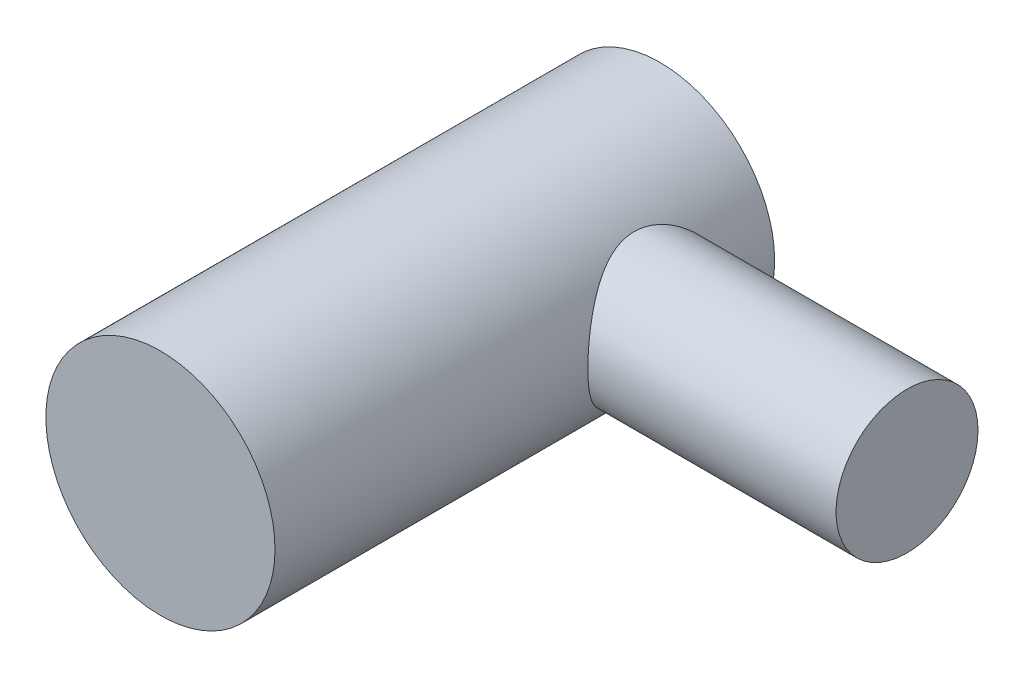
ISO-10303-21;
HEADER;
FILE_DESCRIPTION(('STEP AP214'),'2;1');
FILE_NAME('part.step','',(''),(''),'','','');
FILE_SCHEMA(('AUTOMOTIVE_DESIGN { 1 0 10303 214 1 1 1 1 }'));
ENDSEC;
DATA;
#1=APPLICATION_CONTEXT('core data for automotive mechanical design processes');
#2=APPLICATION_PROTOCOL_DEFINITION('international standard','automotive_design',2000,#1);
#3=PRODUCT_CONTEXT('',#1,'mechanical');
#4=PRODUCT('Part','Part','',(#3));
#5=PRODUCT_RELATED_PRODUCT_CATEGORY('part','',(#4));
#6=PRODUCT_DEFINITION_FORMATION('','',#4);
#7=PRODUCT_DEFINITION_CONTEXT('part definition',#1,'design');
#8=PRODUCT_DEFINITION('design','',#6,#7);
#9=PRODUCT_DEFINITION_SHAPE('','',#8);
#10=(LENGTH_UNIT() NAMED_UNIT(*) SI_UNIT(.MILLI.,.METRE.));
#11=(NAMED_UNIT(*) PLANE_ANGLE_UNIT() SI_UNIT($,.RADIAN.));
#12=(NAMED_UNIT(*) SI_UNIT($,.STERADIAN.) SOLID_ANGLE_UNIT());
#13=UNCERTAINTY_MEASURE_WITH_UNIT(LENGTH_MEASURE(1.E-05),#10,'distance_accuracy_value','');
#14=(GEOMETRIC_REPRESENTATION_CONTEXT(3) GLOBAL_UNCERTAINTY_ASSIGNED_CONTEXT((#13)) GLOBAL_UNIT_ASSIGNED_CONTEXT((#10,
#11,#12)) REPRESENTATION_CONTEXT('',''));
#15=CARTESIAN_POINT('',(0.,0.,0.));
#16=DIRECTION('',(0.,0.,1.));
#17=DIRECTION('',(1.,0.,0.));
#18=AXIS2_PLACEMENT_3D('',#15,#16,#17);
#19=CARTESIAN_POINT('',(0.,0.,78.5));
#20=DIRECTION('',(0.,0.,-1.));
#21=DIRECTION('',(-1.,0.,0.));
#22=AXIS2_PLACEMENT_3D('',#19,#20,#21);
#23=CYLINDRICAL_SURFACE('',#22,18.);
#24=CARTESIAN_POINT('',(0.,0.,0.));
#25=DIRECTION('',(0.,0.,1.));
#26=DIRECTION('',(1.,0.,0.));
#27=AXIS2_PLACEMENT_3D('',#24,#25,#26);
#28=CIRCLE('',#27,18.);
#29=CARTESIAN_POINT('',(18.,0.,0.));
#30=VERTEX_POINT('',#29);
#31=EDGE_CURVE('E44',#30,#30,#28,.T.);
#32=ORIENTED_EDGE('',*,*,#31,.T.);
#33=EDGE_LOOP('',(#32));
#34=FACE_BOUND('',#33,.T.);
#35=CARTESIAN_POINT('',(0.,0.,78.5));
#36=DIRECTION('',(0.,0.,1.));
#37=DIRECTION('',(1.,0.,0.));
#38=AXIS2_PLACEMENT_3D('',#35,#36,#37);
#39=CIRCLE('',#38,18.);
#40=CARTESIAN_POINT('',(18.,0.,78.5));
#41=VERTEX_POINT('',#40);
#42=EDGE_CURVE('E40',#41,#41,#39,.T.);
#43=ORIENTED_EDGE('',*,*,#42,.F.);
#44=EDGE_LOOP('',(#43));
#45=FACE_BOUND('',#44,.T.);
#46=CARTESIAN_POINT('',(18.,0.,29.35));
#47=CARTESIAN_POINT('',(17.9999987592474,-0.283821445849497,29.349998717285));
#48=CARTESIAN_POINT('',(17.9932716467578,-0.567670395337147,29.3391480287929));
#49=CARTESIAN_POINT('',(17.9665257820099,-1.13320259285097,29.2958925853563));
#50=CARTESIAN_POINT('',(17.9465008046661,-1.4148847640479,29.2634777356394));
#51=CARTESIAN_POINT('',(17.8936097386061,-1.97428570977138,29.1774733272145));
#52=CARTESIAN_POINT('',(17.8607207559977,-2.25199649799965,29.1238460150476));
#53=CARTESIAN_POINT('',(17.7829068289777,-2.80090490434231,28.9961490912365));
#54=CARTESIAN_POINT('',(17.7379831490258,-3.07210320345,28.9220816271707));
#55=CARTESIAN_POINT('',(17.6373916544237,-3.6049365029869,28.7548340943842));
#56=CARTESIAN_POINT('',(17.5817785795606,-3.86661247628248,28.6617512559502));
#57=CARTESIAN_POINT('',(17.4608702716811,-4.38037251759884,28.4572554410721));
#58=CARTESIAN_POINT('',(17.395574819638,-4.63245636847232,28.3458420499629));
#59=CARTESIAN_POINT('',(17.2566664458809,-5.12572867292912,28.1057869289417));
#60=CARTESIAN_POINT('',(17.1830572620478,-5.36692195520842,27.9771529366855));
#61=CARTESIAN_POINT('',(17.0288887643703,-5.83766411935418,27.7035952571812));
#62=CARTESIAN_POINT('',(16.9483268852947,-6.06720865332626,27.5586655515255));
#63=CARTESIAN_POINT('',(16.7751755006341,-6.53143174168691,27.2414626025618));
#64=CARTESIAN_POINT('',(16.6821385472182,-6.76508562507958,27.0679340595276));
#65=CARTESIAN_POINT('',(16.4916407379307,-7.21705898660134,26.7041594256885));
#66=CARTESIAN_POINT('',(16.3941797137181,-7.43537788041033,26.5139126984798));
#67=CARTESIAN_POINT('',(16.1966853503522,-7.85630333761377,26.1173683875126));
#68=CARTESIAN_POINT('',(16.0966485881586,-8.05888738478239,25.9110486188858));
#69=CARTESIAN_POINT('',(15.8962507233636,-8.44730519989292,25.4834705917961));
#70=CARTESIAN_POINT('',(15.7958897088904,-8.63314317789093,25.2622161126069));
#71=CARTESIAN_POINT('',(15.5837912123958,-9.01101590463769,24.7750536092759));
#72=CARTESIAN_POINT('',(15.4723139017558,-9.20059330757125,24.5071185413935));
#73=CARTESIAN_POINT('',(15.2551422800028,-9.55636371147948,23.9538334686093));
#74=CARTESIAN_POINT('',(15.1494490248958,-9.72255245098866,23.6684803036366));
#75=CARTESIAN_POINT('',(14.9477175606358,-10.0299300148459,23.0818547944633));
#76=CARTESIAN_POINT('',(14.8516664864173,-10.1711523474617,22.7806045028582));
#77=CARTESIAN_POINT('',(14.6730362261627,-10.4271953948411,22.1632863183425));
#78=CARTESIAN_POINT('',(14.5904515906926,-10.5420267969046,21.847224486177));
#79=CARTESIAN_POINT('',(14.4616093863161,-10.7177656145098,21.28468824053));
#80=CARTESIAN_POINT('',(14.4114604698533,-10.7849551357616,21.0410522945054));
#81=CARTESIAN_POINT('',(14.3223995294114,-10.9029513921417,20.5478503307304));
#82=CARTESIAN_POINT('',(14.2834848324764,-10.9537620246323,20.2982857389011));
#83=CARTESIAN_POINT('',(14.2182669283702,-11.0382853230186,19.7949314970705));
#84=CARTESIAN_POINT('',(14.191949421993,-11.0720173775157,19.5411469775125));
#85=CARTESIAN_POINT('',(14.1528451345156,-11.1219597688712,19.0308056981972));
#86=CARTESIAN_POINT('',(14.1400585506443,-11.1381698503265,18.7742488980857));
#87=CARTESIAN_POINT('',(14.1285079852823,-11.1528181497835,18.2596709507465));
#88=CARTESIAN_POINT('',(14.1297788693851,-11.151212180055,18.0016477497165));
#89=CARTESIAN_POINT('',(14.1463761834195,-11.1301489870178,17.48679065471));
#90=CARTESIAN_POINT('',(14.1617026858649,-11.1106916716131,17.229956766876));
#91=CARTESIAN_POINT('',(14.2058222252905,-11.0542249851804,16.7192332364843));
#92=CARTESIAN_POINT('',(14.2346244455277,-11.0172036446072,16.4653457228831));
#93=CARTESIAN_POINT('',(14.3046268403519,-10.926158359672,15.9623924592358));
#94=CARTESIAN_POINT('',(14.3458272907125,-10.8721340371118,15.7133268165737));
#95=CARTESIAN_POINT('',(14.4382461392049,-10.749085169012,15.226553460578));
#96=CARTESIAN_POINT('',(14.4892381687512,-10.6803962515719,14.9887172436568));
#97=CARTESIAN_POINT('',(14.6002803608494,-10.5280905336692,14.5199774886915));
#98=CARTESIAN_POINT('',(14.6603334736105,-10.4444688696018,14.2890762380794));
#99=CARTESIAN_POINT('',(14.7879238540058,-10.2630210885235,13.8350637078396));
#100=CARTESIAN_POINT('',(14.8554614518615,-10.1651943447138,13.6119527724984));
#101=CARTESIAN_POINT('',(14.9964652838849,-9.95600020644432,13.1741234793431));
#102=CARTESIAN_POINT('',(15.0699318092026,-9.84463214687899,12.9594055344506));
#103=CARTESIAN_POINT('',(15.2352477358945,-9.58721684125018,12.5000634805407));
#104=CARTESIAN_POINT('',(15.3279899323906,-9.43856083396791,12.2572195720634));
#105=CARTESIAN_POINT('',(15.5173401218241,-9.12391782185399,11.7846096022869));
#106=CARTESIAN_POINT('',(15.6139485667229,-8.95792878713275,11.5548450776081));
#107=CARTESIAN_POINT('',(15.8089180015492,-8.60918414174804,11.1088328747434));
#108=CARTESIAN_POINT('',(15.9072804843498,-8.42641363990885,10.892597493449));
#109=CARTESIAN_POINT('',(16.1036085981647,-8.04486378928273,10.4745378476898));
#110=CARTESIAN_POINT('',(16.2015742038816,-7.84608343636341,10.2727144886423));
#111=CARTESIAN_POINT('',(16.4105699779724,-7.40020672105662,9.85329794294202));
#112=CARTESIAN_POINT('',(16.5211962785141,-7.15045716328366,9.63831159549863));
#113=CARTESIAN_POINT('',(16.736363169135,-6.6312241415501,9.23013797642478));
#114=CARTESIAN_POINT('',(16.8409030526621,-6.36173839464712,9.03695323323731));
#115=CARTESIAN_POINT('',(17.0410536185381,-5.80432145004601,8.67409313441487));
#116=CARTESIAN_POINT('',(17.1366666586093,-5.51639515685648,8.50441156545695));
#117=CARTESIAN_POINT('',(17.3162917595736,-4.9236075368432,8.19035197910722));
#118=CARTESIAN_POINT('',(17.4003052167319,-4.6187482544835,8.04597091567809));
#119=CARTESIAN_POINT('',(17.5498806853134,-4.0117113555674,7.79179353670592));
#120=CARTESIAN_POINT('',(17.616215181194,-3.71034894633803,7.68050781506698));
#121=CARTESIAN_POINT('',(17.7344077141105,-3.09651971081593,7.48375487525453));
#122=CARTESIAN_POINT('',(17.7862660571263,-2.7840531193879,7.39828711136793));
#123=CARTESIAN_POINT('',(17.8738618228074,-2.15105374181713,7.25465054880422));
#124=CARTESIAN_POINT('',(17.9096175122365,-1.83053053325333,7.19645081437963));
#125=CARTESIAN_POINT('',(17.9639297846705,-1.18420069140378,7.10826924489053));
#126=CARTESIAN_POINT('',(17.9824891828777,-0.858394931812986,7.07828279102151));
#127=CARTESIAN_POINT('',(18.0003954338148,-0.25257817789304,7.04935774219158));
#128=CARTESIAN_POINT('',(18.0021486348921,0.0271849431984273,7.04653031452067));
#129=CARTESIAN_POINT('',(17.9926307012107,0.58588972776195,7.06189864498594));
#130=CARTESIAN_POINT('',(17.9813610892004,0.864831483452475,7.08009194518311));
#131=CARTESIAN_POINT('',(17.9460761222508,1.41973749817611,7.13724039347287));
#132=CARTESIAN_POINT('',(17.9220614618026,1.69570191861142,7.17619441029257));
#133=CARTESIAN_POINT('',(17.8618642404714,2.2426557764784,7.27433318908481));
#134=CARTESIAN_POINT('',(17.82568144262,2.51364511691453,7.33351834504886));
#135=CARTESIAN_POINT('',(17.7434922852079,3.03918962183712,7.46888632703224));
#136=CARTESIAN_POINT('',(17.6978857239098,3.29398539745184,7.54438180362782));
#137=CARTESIAN_POINT('',(17.5970603680582,3.79592153966619,7.71269456612506));
#138=CARTESIAN_POINT('',(17.5418382472895,4.04305922221523,7.80551784686583));
#139=CARTESIAN_POINT('',(17.4228793942645,4.528318745485,8.00755718251161));
#140=CARTESIAN_POINT('',(17.3591450482719,4.7664430890252,8.11676864431309));
#141=CARTESIAN_POINT('',(17.2242936744406,5.23284519207898,8.35073944204855));
#142=CARTESIAN_POINT('',(17.1531739778937,5.4611193497387,8.47550440155162));
#143=CARTESIAN_POINT('',(16.9972761286588,5.92954890968314,8.75307503069347));
#144=CARTESIAN_POINT('',(16.911844247767,6.1685624432421,8.90744116188689));
#145=CARTESIAN_POINT('',(16.735221352245,6.63280375464158,9.23290321443068));
#146=CARTESIAN_POINT('',(16.644027813531,6.85802540421312,9.40400648628499));
#147=CARTESIAN_POINT('',(16.4576134143433,7.29405388306295,9.76205455877938));
#148=CARTESIAN_POINT('',(16.3623893475183,7.50484887312961,9.94901209505542));
#149=CARTESIAN_POINT('',(16.1698241097529,7.91121701840377,10.3377972702553));
#150=CARTESIAN_POINT('',(16.0724827829376,8.10678904799476,10.5396260066419));
#151=CARTESIAN_POINT('',(15.8637499663294,8.50880412355682,10.987120914529));
#152=CARTESIAN_POINT('',(15.7523279181111,8.71284151165848,11.234940565909));
#153=CARTESIAN_POINT('',(15.532256795595,9.0993666417368,11.7480835936016));
#154=CARTESIAN_POINT('',(15.423608189705,9.281850762203,12.0134098998476));
#155=CARTESIAN_POINT('',(15.2124626200832,9.62399926792061,12.5603973607896));
#156=CARTESIAN_POINT('',(15.1099606599542,9.78368233730786,12.8420448720119));
#157=CARTESIAN_POINT('',(14.914512116809,10.0791229651915,13.4209454356106));
#158=CARTESIAN_POINT('',(14.8215673927879,10.2148758726439,13.7182015071133));
#159=CARTESIAN_POINT('',(14.6673069386498,10.4347560257756,14.262325043804));
#160=CARTESIAN_POINT('',(14.6034620871954,10.5237274573066,14.5065255526989));
#161=CARTESIAN_POINT('',(14.4859422049954,10.6849160147508,15.0026514103789));
#162=CARTESIAN_POINT('',(14.4322610395801,10.7571432531898,15.2545719920431));
#163=CARTESIAN_POINT('',(14.3368475865173,10.8839840010633,15.764757857994));
#164=CARTESIAN_POINT('',(14.2951026281331,10.9386161961503,16.023016095909));
#165=CARTESIAN_POINT('',(14.2250223823648,11.0295987836932,16.5445524827031));
#166=CARTESIAN_POINT('',(14.1966870792867,11.0659491975453,16.8078306257066));
#167=CARTESIAN_POINT('',(14.1544548454684,11.1199190911948,17.338893940692));
#168=CARTESIAN_POINT('',(14.1406356534187,11.1374377320216,17.606695653064));
#169=CARTESIAN_POINT('',(14.1282979598876,11.1530847474312,18.1432215883231));
#170=CARTESIAN_POINT('',(14.1297794191978,11.1512131717022,18.4119458088444));
#171=CARTESIAN_POINT('',(14.1479811553154,11.1281103567775,18.9481287329101));
#172=CARTESIAN_POINT('',(14.1647068352004,11.1068722534153,19.2155869539526));
#173=CARTESIAN_POINT('',(14.2126910286781,11.0454028104838,19.7469722148091));
#174=CARTESIAN_POINT('',(14.2439494067843,11.0051716479845,20.01089928752));
#175=CARTESIAN_POINT('',(14.3169654717042,10.9099866948455,20.5141719565656));
#176=CARTESIAN_POINT('',(14.3577856955723,10.8563281153236,20.7539014027667));
#177=CARTESIAN_POINT('',(14.4495457090594,10.7338932208649,21.2275269704236));
#178=CARTESIAN_POINT('',(14.5004888726192,10.6651118647427,21.461421117661));
#179=CARTESIAN_POINT('',(14.6663446164895,10.4371330636105,22.1527266099354));
#180=CARTESIAN_POINT('',(14.7943213104134,10.256253814885,22.6000050069906));
#181=CARTESIAN_POINT('',(15.0936065681613,9.81145696643401,23.5253246604267));
#182=CARTESIAN_POINT('',(15.268522029096,9.53922785020658,23.9981770612847));
#183=CARTESIAN_POINT('',(15.5406913964445,9.08396255013767,24.6712926780466));
#184=CARTESIAN_POINT('',(15.6331121768411,8.9242648923857,24.8897711041264));
#185=CARTESIAN_POINT('',(15.8194103792654,8.58969596306938,25.3142563932527));
#186=CARTESIAN_POINT('',(15.9132880344737,8.41482224149045,25.5202612334233));
#187=CARTESIAN_POINT('',(16.1185551642167,8.01571481129545,25.9572091031637));
#188=CARTESIAN_POINT('',(16.2298677667406,7.78842994903144,26.1854092101639));
#189=CARTESIAN_POINT('',(16.4490562817262,7.31415006336979,26.6219695254131));
#190=CARTESIAN_POINT('',(16.5569331100909,7.06716035544659,26.830335051094));
#191=CARTESIAN_POINT('',(16.7666556687439,6.55408888506633,27.226152966618));
#192=CARTESIAN_POINT('',(16.8684961739607,6.28799101063273,27.4135873589236));
#193=CARTESIAN_POINT('',(17.014627340161,5.87569071383283,27.677626276916));
#194=CARTESIAN_POINT('',(17.0622316458802,5.736068833671,27.7627851469414));
#195=CARTESIAN_POINT('',(17.1549472566134,5.45252660823807,27.9272467878612));
#196=CARTESIAN_POINT('',(17.2000574852533,5.30860444772961,28.0065470352261));
#197=CARTESIAN_POINT('',(17.3306059109159,4.87254650648989,28.2343338598673));
#198=CARTESIAN_POINT('',(17.4118877926051,4.57437032377064,28.3738285472263));
#199=CARTESIAN_POINT('',(17.560904070506,3.96400360259716,28.626806654074));
#200=CARTESIAN_POINT('',(17.6286411066894,3.65181580964247,28.7402951429575));
#201=CARTESIAN_POINT('',(17.7483369635785,3.01672403403095,28.9392860894945));
#202=CARTESIAN_POINT('',(17.8003421201527,2.69385469116407,29.0248707926072));
#203=CARTESIAN_POINT('',(17.8870997398185,2.0396951068224,29.1669512165517));
#204=CARTESIAN_POINT('',(17.9218653040373,1.70841146164113,29.2234690278145));
#205=CARTESIAN_POINT('',(17.9648627569183,1.14711292217803,29.2932076921999));
#206=CARTESIAN_POINT('',(17.9780183724456,0.918436307093833,29.3144844152929));
#207=CARTESIAN_POINT('',(17.9955877612888,0.459845861022994,29.3428815174529));
#208=CARTESIAN_POINT('',(18.0000010051696,0.229931955951867,29.3500010391645));
#209=CARTESIAN_POINT('',(18.,0.,29.35));
#210=B_SPLINE_CURVE_WITH_KNOTS('',3,(#46,#47,#48,#49,#50,#51,#52,#53,#54,#55,#56,#57,#58,#59,
#60,#61,#62,#63,#64,#65,#66,#67,#68,#69,#70,#71,#72,#73,#74,#75,#76,#77,#78,#79,#80,#81,#82,#83,
#84,#85,#86,#87,#88,#89,#90,#91,#92,#93,#94,#95,#96,#97,#98,#99,#100,#101,#102,#103,#104,#105,
#106,#107,#108,#109,#110,#111,#112,#113,#114,#115,#116,#117,#118,#119,#120,#121,#122,#123,#124,
#125,#126,#127,#128,#129,#130,#131,#132,#133,#134,#135,#136,#137,#138,#139,#140,#141,#142,#143,
#144,#145,#146,#147,#148,#149,#150,#151,#152,#153,#154,#155,#156,#157,#158,#159,#160,#161,#162,
#163,#164,#165,#166,#167,#168,#169,#170,#171,#172,#173,#174,#175,#176,#177,#178,#179,#180,#181,
#182,#183,#184,#185,#186,#187,#188,#189,#190,#191,#192,#193,#194,#195,#196,#197,#198,#199,#200,
#201,#202,#203,#204,#205,#206,#207,#208,#209),.UNSPECIFIED.,.T.,.F.,(4,2,2,2,2,2,2,2,2,2,2,2,2,
2,2,2,2,2,2,2,2,2,2,2,2,2,2,2,2,2,2,2,2,2,2,2,2,2,2,2,2,2,2,2,2,2,2,2,2,2,2,2,2,2,2,2,2,2,2,2,2,
2,2,2,2,2,2,2,2,2,2,2,2,2,2,2,2,2,2,2,2,4),(0.,0.851227435244229,1.70285363394782,
2.55600240715437,3.40906157698045,4.25786337555589,5.10668437796114,5.95512525555706,
6.80388051891612,7.71962392604567,8.63540220749608,9.55246768665434,10.4693019633703,
11.5079527387531,12.5467925142463,13.5842272638382,14.6212411495316,15.3934621404566,
16.1654992452602,16.9366579119801,17.7078278190822,18.4809108241276,19.2539978175674,
20.0276124133436,20.8012442178835,21.5587732508271,22.3165494629465,23.0743591220873,
23.8322060174248,24.7297039562759,25.6273071202115,26.5257146228235,27.4241785171932,
28.4657196445303,29.5073814408269,30.5487673346298,31.59002776521,32.5726693238886,
33.5552901110605,34.5367933932393,35.518135965252,36.3564209596407,37.1946079438703,
38.0327492590943,38.8709068976393,39.6789409666062,40.4872551081067,41.2953431256621,
42.1037241699814,42.9940638031475,43.8847962203049,44.7762510611897,45.6677717555567,
46.6860046290553,47.7044083495383,48.7219726983934,49.7397346025741,50.5418728118755,
51.3435253065707,52.1443236302916,52.9451210167959,53.7501854142416,54.5552477486773,
55.3605955359775,56.1659358152677,56.9122491487902,57.6588116444589,59.1511901827622,
60.86362487581,61.7209874418565,62.5784886784019,63.5996266631508,64.6204901165286,
65.6422247035708,66.1530654446627,66.6641249564882,67.6797578631682,68.6951926235364,
69.7076067829977,70.7192503806339,71.408812568701,72.0984165151532),.UNSPECIFIED.);
#211=CARTESIAN_POINT('',(18.,0.,29.35));
#212=VERTEX_POINT('',#211);
#213=EDGE_CURVE('E10',#212,#212,#210,.T.);
#214=ORIENTED_EDGE('',*,*,#213,.F.);
#215=EDGE_LOOP('',(#214));
#216=FACE_BOUND('',#215,.T.);
#217=ADVANCED_FACE('F30',(#34,#45,#216),#23,.T.);
#218=CARTESIAN_POINT('',(0.,0.,78.5));
#219=DIRECTION('',(0.,0.,1.));
#220=DIRECTION('',(1.,0.,0.));
#221=AXIS2_PLACEMENT_3D('',#218,#219,#220);
#222=PLANE('',#221);
#223=ORIENTED_EDGE('',*,*,#42,.T.);
#224=EDGE_LOOP('',(#223));
#225=FACE_BOUND('',#224,.T.);
#226=ADVANCED_FACE('F64',(#225),#222,.T.);
#227=CARTESIAN_POINT('',(0.,0.,0.));
#228=DIRECTION('',(0.,0.,1.));
#229=DIRECTION('',(1.,0.,0.));
#230=AXIS2_PLACEMENT_3D('',#227,#228,#229);
#231=PLANE('',#230);
#232=ORIENTED_EDGE('',*,*,#31,.F.);
#233=EDGE_LOOP('',(#232));
#234=FACE_BOUND('',#233,.T.);
#235=ADVANCED_FACE('F58',(#234),#231,.F.);
#236=CARTESIAN_POINT('',(57.,0.,18.2));
#237=DIRECTION('',(-1.,0.,0.));
#238=DIRECTION('',(0.,0.,1.));
#239=AXIS2_PLACEMENT_3D('',#236,#237,#238);
#240=CYLINDRICAL_SURFACE('',#239,11.15);
#241=CARTESIAN_POINT('',(57.,0.,18.2));
#242=DIRECTION('',(1.,0.,0.));
#243=DIRECTION('',(0.,0.,-1.));
#244=AXIS2_PLACEMENT_3D('',#241,#242,#243);
#245=CIRCLE('',#244,11.15);
#246=CARTESIAN_POINT('',(57.,0.,7.05));
#247=VERTEX_POINT('',#246);
#248=EDGE_CURVE('E49',#247,#247,#245,.T.);
#249=ORIENTED_EDGE('',*,*,#248,.F.);
#250=EDGE_LOOP('',(#249));
#251=FACE_BOUND('',#250,.T.);
#252=ORIENTED_EDGE('',*,*,#213,.T.);
#253=EDGE_LOOP('',(#252));
#254=FACE_BOUND('',#253,.T.);
#255=ADVANCED_FACE('F56',(#251,#254),#240,.T.);
#256=CARTESIAN_POINT('',(57.,0.,18.2));
#257=DIRECTION('',(1.,0.,0.));
#258=DIRECTION('',(0.,0.,-1.));
#259=AXIS2_PLACEMENT_3D('',#256,#257,#258);
#260=PLANE('',#259);
#261=ORIENTED_EDGE('',*,*,#248,.T.);
#262=EDGE_LOOP('',(#261));
#263=FACE_BOUND('',#262,.T.);
#264=ADVANCED_FACE('F54',(#263),#260,.T.);
#265=CLOSED_SHELL('',(#217,#226,#235,#255,#264));
#266=MANIFOLD_SOLID_BREP('B2',#265);
#267=ADVANCED_BREP_SHAPE_REPRESENTATION('',(#18,#266),#14);
#268=SHAPE_DEFINITION_REPRESENTATION(#9,#267);
ENDSEC;
END-ISO-10303-21;
